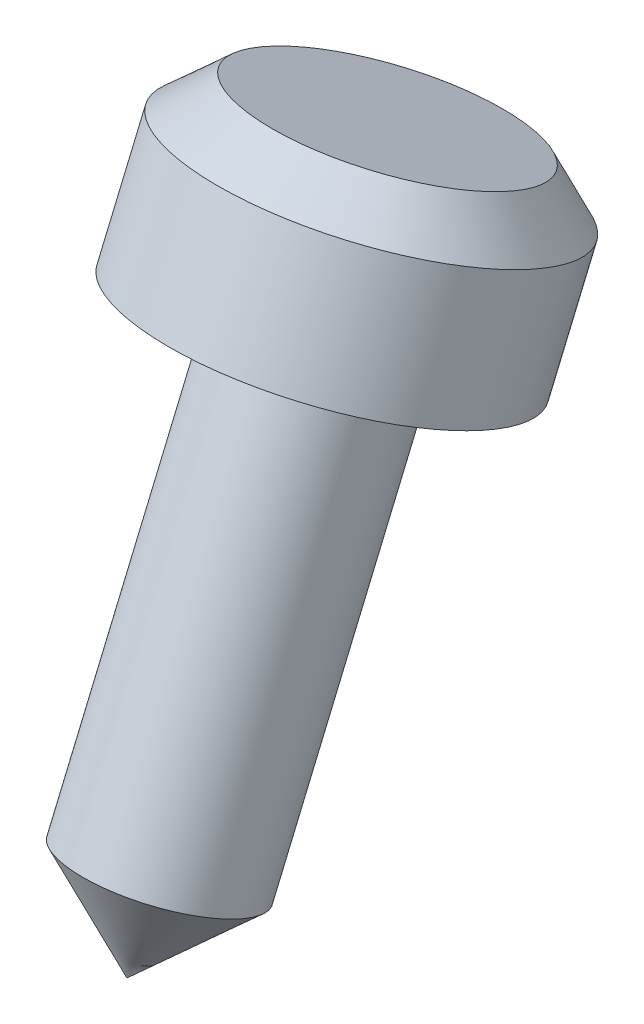
ISO-10303-21;
HEADER;
FILE_DESCRIPTION(('STEP AP214'),'2;1');
FILE_NAME('part.step','',(''),(''),'','','');
FILE_SCHEMA(('AUTOMOTIVE_DESIGN { 1 0 10303 214 1 1 1 1 }'));
ENDSEC;
DATA;
#1=APPLICATION_CONTEXT('core data for automotive mechanical design processes');
#2=APPLICATION_PROTOCOL_DEFINITION('international standard','automotive_design',2000,#1);
#3=PRODUCT_CONTEXT('',#1,'mechanical');
#4=PRODUCT('Part','Part','',(#3));
#5=PRODUCT_RELATED_PRODUCT_CATEGORY('part','',(#4));
#6=PRODUCT_DEFINITION_FORMATION('','',#4);
#7=PRODUCT_DEFINITION_CONTEXT('part definition',#1,'design');
#8=PRODUCT_DEFINITION('design','',#6,#7);
#9=PRODUCT_DEFINITION_SHAPE('','',#8);
#10=(LENGTH_UNIT() NAMED_UNIT(*) SI_UNIT(.MILLI.,.METRE.));
#11=(NAMED_UNIT(*) PLANE_ANGLE_UNIT() SI_UNIT($,.RADIAN.));
#12=(NAMED_UNIT(*) SI_UNIT($,.STERADIAN.) SOLID_ANGLE_UNIT());
#13=UNCERTAINTY_MEASURE_WITH_UNIT(LENGTH_MEASURE(1.E-05),#10,'distance_accuracy_value','');
#14=(GEOMETRIC_REPRESENTATION_CONTEXT(3) GLOBAL_UNCERTAINTY_ASSIGNED_CONTEXT((#13)) GLOBAL_UNIT_ASSIGNED_CONTEXT((#10,
#11,#12)) REPRESENTATION_CONTEXT('',''));
#15=CARTESIAN_POINT('',(0.,0.,0.));
#16=DIRECTION('',(0.,0.,1.));
#17=DIRECTION('',(1.,0.,0.));
#18=AXIS2_PLACEMENT_3D('',#15,#16,#17);
#19=CARTESIAN_POINT('',(522.658686102802,-855.348716235142,627.015745479865));
#20=DIRECTION('',(0.,0.920504853452442,-0.390731128489269));
#21=DIRECTION('',(0.,0.390731128489269,0.920504853452442));
#22=AXIS2_PLACEMENT_3D('',#19,#20,#21);
#23=CONICAL_SURFACE('',#22,0.,0.785398163397449);
#24=CARTESIAN_POINT('',(522.658686102802,-846.143667700617,623.108434194972));
#25=DIRECTION('',(0.,-0.920504853452442,0.390731128489269));
#26=DIRECTION('',(0.,-0.390731128489269,-0.920504853452442));
#27=AXIS2_PLACEMENT_3D('',#24,#25,#26);
#28=CIRCLE('',#27,10.0000000000002);
#29=CARTESIAN_POINT('',(522.658686102802,-850.05097898551,613.903385660447));
#30=VERTEX_POINT('',#29);
#31=EDGE_CURVE('E86',#30,#30,#28,.T.);
#32=ORIENTED_EDGE('',*,*,#31,.T.);
#33=EDGE_LOOP('',(#32));
#34=FACE_BOUND('',#33,.T.);
#35=CARTESIAN_POINT('',(522.658686102802,-855.348716235142,627.015745479865));
#36=VERTEX_POINT('',#35);
#37=VERTEX_LOOP('',#36);
#38=FACE_BOUND('',#37,.T.);
#39=ADVANCED_FACE('F43',(#34,#38),#23,.T.);
#40=CARTESIAN_POINT('',(542.658686102802,-781.708327958944,595.757255200722));
#41=DIRECTION('',(0.,0.920504853452442,-0.390731128489269));
#42=DIRECTION('',(0.,0.390731128489269,0.920504853452442));
#43=AXIS2_PLACEMENT_3D('',#40,#41,#42);
#44=PLANE('',#43);
#45=CARTESIAN_POINT('',(522.658686102802,-781.708327958944,595.757255200722));
#46=DIRECTION('',(0.,0.920504853452442,-0.390731128489269));
#47=DIRECTION('',(0.,0.390731128489269,0.920504853452442));
#48=AXIS2_PLACEMENT_3D('',#45,#46,#47);
#49=CIRCLE('',#48,15.);
#50=CARTESIAN_POINT('',(522.658686102802,-775.847361031605,609.564828002509));
#51=VERTEX_POINT('',#50);
#52=EDGE_CURVE('E11',#51,#51,#49,.T.);
#53=ORIENTED_EDGE('',*,*,#52,.T.);
#54=EDGE_LOOP('',(#53));
#55=FACE_BOUND('',#54,.T.);
#56=ADVANCED_FACE('F55',(#55),#44,.T.);
#57=CARTESIAN_POINT('',(522.658686102802,-855.348716235142,627.015745479865));
#58=DIRECTION('',(0.,-0.920504853452442,0.390731128489269));
#59=DIRECTION('',(0.,-0.390731128489269,-0.920504853452442));
#60=AXIS2_PLACEMENT_3D('',#57,#58,#59);
#61=CYLINDRICAL_SURFACE('',#60,20.);
#62=CARTESIAN_POINT('',(522.658686102802,-786.310852226206,597.710910843168));
#63=DIRECTION('',(0.,0.920504853452443,-0.390731128489268));
#64=DIRECTION('',(0.,0.390731128489268,0.920504853452443));
#65=AXIS2_PLACEMENT_3D('',#62,#63,#64);
#66=CIRCLE('',#65,20.);
#67=CARTESIAN_POINT('',(522.658686102802,-778.496229656421,616.121007912217));
#68=VERTEX_POINT('',#67);
#69=EDGE_CURVE('E51',#68,#68,#66,.F.);
#70=ORIENTED_EDGE('',*,*,#69,.T.);
#71=EDGE_LOOP('',(#70));
#72=FACE_BOUND('',#71,.T.);
#73=CARTESIAN_POINT('',(522.658686102802,-800.118425027993,603.571877770507));
#74=DIRECTION('',(0.,-0.920504853452442,0.390731128489269));
#75=DIRECTION('',(0.,-0.390731128489269,-0.920504853452442));
#76=AXIS2_PLACEMENT_3D('',#73,#74,#75);
#77=CIRCLE('',#76,19.9999999999999);
#78=CARTESIAN_POINT('',(522.658686102802,-807.933047597778,585.161780701458));
#79=VERTEX_POINT('',#78);
#80=EDGE_CURVE('E88',#79,#79,#77,.T.);
#81=ORIENTED_EDGE('',*,*,#80,.F.);
#82=EDGE_LOOP('',(#81));
#83=FACE_BOUND('',#82,.T.);
#84=ADVANCED_FACE('F61',(#72,#83),#61,.T.);
#85=CARTESIAN_POINT('',(532.658686102802,-800.118425027993,603.571877770508));
#86=DIRECTION('',(0.,-0.920504853452442,0.390731128489269));
#87=DIRECTION('',(0.,-0.390731128489269,-0.920504853452442));
#88=AXIS2_PLACEMENT_3D('',#85,#86,#87);
#89=PLANE('',#88);
#90=ORIENTED_EDGE('',*,*,#80,.T.);
#91=EDGE_LOOP('',(#90));
#92=FACE_BOUND('',#91,.T.);
#93=CARTESIAN_POINT('',(522.658686102802,-800.118425027993,603.571877770507));
#94=DIRECTION('',(0.,-0.920504853452442,0.390731128489269));
#95=DIRECTION('',(0.,-0.390731128489269,-0.920504853452442));
#96=AXIS2_PLACEMENT_3D('',#93,#94,#95);
#97=CIRCLE('',#96,10.0000000000001);
#98=CARTESIAN_POINT('',(522.658686102802,-804.025736312886,594.366829235983));
#99=VERTEX_POINT('',#98);
#100=EDGE_CURVE('E84',#99,#99,#97,.T.);
#101=ORIENTED_EDGE('',*,*,#100,.F.);
#102=EDGE_LOOP('',(#101));
#103=FACE_BOUND('',#102,.T.);
#104=ADVANCED_FACE('F68',(#92,#103),#89,.T.);
#105=CARTESIAN_POINT('',(522.658686102802,-855.348716235142,627.015745479865));
#106=DIRECTION('',(0.,-0.920504853452442,0.390731128489269));
#107=DIRECTION('',(0.,-0.390731128489269,-0.920504853452442));
#108=AXIS2_PLACEMENT_3D('',#105,#106,#107);
#109=CYLINDRICAL_SURFACE('',#108,10.0000000000002);
#110=ORIENTED_EDGE('',*,*,#100,.T.);
#111=EDGE_LOOP('',(#110));
#112=FACE_BOUND('',#111,.T.);
#113=ORIENTED_EDGE('',*,*,#31,.F.);
#114=EDGE_LOOP('',(#113));
#115=FACE_BOUND('',#114,.T.);
#116=ADVANCED_FACE('F72',(#112,#115),#109,.T.);
#117=CARTESIAN_POINT('',(522.658686102802,-786.310852226206,597.710910843168));
#118=DIRECTION('',(0.,-0.920504853452443,0.390731128489268));
#119=DIRECTION('',(0.,-0.390731128489268,-0.920504853452443));
#120=AXIS2_PLACEMENT_3D('',#117,#118,#119);
#121=CONICAL_SURFACE('',#120,20.,0.78539816339746);
#122=ORIENTED_EDGE('',*,*,#52,.F.);
#123=EDGE_LOOP('',(#122));
#124=FACE_BOUND('',#123,.T.);
#125=ORIENTED_EDGE('',*,*,#69,.F.);
#126=EDGE_LOOP('',(#125));
#127=FACE_BOUND('',#126,.T.);
#128=ADVANCED_FACE('F46',(#124,#127),#121,.T.);
#129=CLOSED_SHELL('',(#39,#56,#84,#104,#116,#128));
#130=MANIFOLD_SOLID_BREP('B2',#129);
#131=ADVANCED_BREP_SHAPE_REPRESENTATION('',(#18,#130),#14);
#132=SHAPE_DEFINITION_REPRESENTATION(#9,#131);
ENDSEC;
END-ISO-10303-21;
